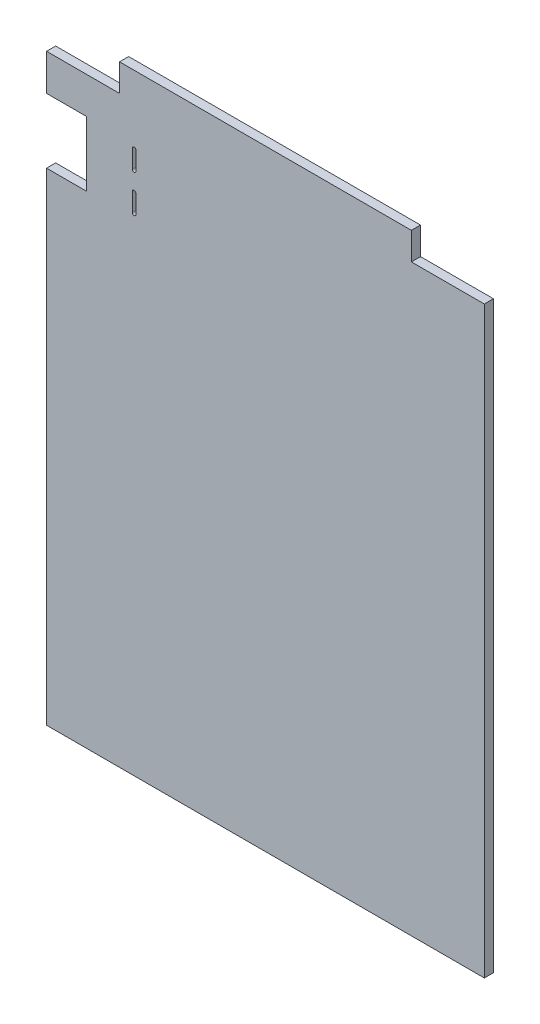
ISO-10303-21;
HEADER;
FILE_DESCRIPTION(('STEP AP214'),'2;1');
FILE_NAME('part.step','',(''),(''),'','','');
FILE_SCHEMA(('AUTOMOTIVE_DESIGN { 1 0 10303 214 1 1 1 1 }'));
ENDSEC;
DATA;
#1=APPLICATION_CONTEXT('core data for automotive mechanical design processes');
#2=APPLICATION_PROTOCOL_DEFINITION('international standard','automotive_design',2000,#1);
#3=PRODUCT_CONTEXT('',#1,'mechanical');
#4=PRODUCT('Part','Part','',(#3));
#5=PRODUCT_RELATED_PRODUCT_CATEGORY('part','',(#4));
#6=PRODUCT_DEFINITION_FORMATION('','',#4);
#7=PRODUCT_DEFINITION_CONTEXT('part definition',#1,'design');
#8=PRODUCT_DEFINITION('design','',#6,#7);
#9=PRODUCT_DEFINITION_SHAPE('','',#8);
#10=(LENGTH_UNIT() NAMED_UNIT(*) SI_UNIT(.MILLI.,.METRE.));
#11=(NAMED_UNIT(*) PLANE_ANGLE_UNIT() SI_UNIT($,.RADIAN.));
#12=(NAMED_UNIT(*) SI_UNIT($,.STERADIAN.) SOLID_ANGLE_UNIT());
#13=UNCERTAINTY_MEASURE_WITH_UNIT(LENGTH_MEASURE(1.E-05),#10,'distance_accuracy_value','');
#14=(GEOMETRIC_REPRESENTATION_CONTEXT(3) GLOBAL_UNCERTAINTY_ASSIGNED_CONTEXT((#13)) GLOBAL_UNIT_ASSIGNED_CONTEXT((#10,
#11,#12)) REPRESENTATION_CONTEXT('',''));
#15=CARTESIAN_POINT('',(0.,0.,0.));
#16=DIRECTION('',(0.,0.,1.));
#17=DIRECTION('',(1.,0.,0.));
#18=AXIS2_PLACEMENT_3D('',#15,#16,#17);
#19=CARTESIAN_POINT('',(-290.,335.,10.));
#20=DIRECTION('',(1.,0.,0.));
#21=DIRECTION('',(0.,1.,0.));
#22=AXIS2_PLACEMENT_3D('',#19,#20,#21);
#23=PLANE('',#22);
#24=DIRECTION('',(0.,-1.,0.));
#25=VECTOR('',#24,1.);
#26=CARTESIAN_POINT('',(-290.,335.,10.));
#27=LINE('',#26,#25);
#28=CARTESIAN_POINT('',(-290.,194.,10.));
#29=VERTEX_POINT('',#28);
#30=CARTESIAN_POINT('',(-290.,-335.,10.));
#31=VERTEX_POINT('',#30);
#32=EDGE_CURVE('E305',#29,#31,#27,.T.);
#33=ORIENTED_EDGE('',*,*,#32,.F.);
#34=DIRECTION('',(0.,0.,-1.));
#35=VECTOR('',#34,1.);
#36=CARTESIAN_POINT('',(-290.,194.,10.));
#37=LINE('',#36,#35);
#38=CARTESIAN_POINT('',(-290.,194.,0.));
#39=VERTEX_POINT('',#38);
#40=EDGE_CURVE('E256',#29,#39,#37,.T.);
#41=ORIENTED_EDGE('',*,*,#40,.T.);
#42=DIRECTION('',(0.,-1.,0.));
#43=VECTOR('',#42,1.);
#44=CARTESIAN_POINT('',(-290.,335.,0.));
#45=LINE('',#44,#43);
#46=CARTESIAN_POINT('',(-290.,-335.,0.));
#47=VERTEX_POINT('',#46);
#48=EDGE_CURVE('E297',#39,#47,#45,.T.);
#49=ORIENTED_EDGE('',*,*,#48,.T.);
#50=DIRECTION('',(0.,0.,-1.));
#51=VECTOR('',#50,1.);
#52=CARTESIAN_POINT('',(-290.,-335.,10.));
#53=LINE('',#52,#51);
#54=EDGE_CURVE('E11',#31,#47,#53,.T.);
#55=ORIENTED_EDGE('',*,*,#54,.F.);
#56=EDGE_LOOP('',(#33,#41,#49,#55));
#57=FACE_BOUND('',#56,.T.);
#58=ADVANCED_FACE('F33',(#57),#23,.F.);
#59=CARTESIAN_POINT('',(-290.,305.,0.));
#60=VERTEX_POINT('',#59);
#61=CARTESIAN_POINT('',(-290.,265.,0.));
#62=VERTEX_POINT('',#61);
#63=EDGE_CURVE('E313',#60,#62,#45,.T.);
#64=ORIENTED_EDGE('',*,*,#63,.T.);
#65=DIRECTION('',(0.,0.,-1.));
#66=VECTOR('',#65,1.);
#67=CARTESIAN_POINT('',(-290.,265.,10.));
#68=LINE('',#67,#66);
#69=CARTESIAN_POINT('',(-290.,265.,10.));
#70=VERTEX_POINT('',#69);
#71=EDGE_CURVE('E249',#70,#62,#68,.T.);
#72=ORIENTED_EDGE('',*,*,#71,.F.);
#73=CARTESIAN_POINT('',(-290.,305.,10.));
#74=VERTEX_POINT('',#73);
#75=EDGE_CURVE('E301',#74,#70,#27,.T.);
#76=ORIENTED_EDGE('',*,*,#75,.F.);
#77=DIRECTION('',(0.,0.,-1.));
#78=VECTOR('',#77,1.);
#79=CARTESIAN_POINT('',(-290.,305.,10.));
#80=LINE('',#79,#78);
#81=EDGE_CURVE('E276',#74,#60,#80,.T.);
#82=ORIENTED_EDGE('',*,*,#81,.T.);
#83=EDGE_LOOP('',(#64,#72,#76,#82));
#84=FACE_BOUND('',#83,.T.);
#85=ADVANCED_FACE('F35',(#84),#23,.F.);
#86=CARTESIAN_POINT('',(-290.,-335.,10.));
#87=DIRECTION('',(0.,1.,0.));
#88=DIRECTION('',(0.,0.,1.));
#89=AXIS2_PLACEMENT_3D('',#86,#87,#88);
#90=PLANE('',#89);
#91=DIRECTION('',(1.,0.,0.));
#92=VECTOR('',#91,1.);
#93=CARTESIAN_POINT('',(-290.,-335.,0.));
#94=LINE('',#93,#92);
#95=CARTESIAN_POINT('',(190.,-335.,0.));
#96=VERTEX_POINT('',#95);
#97=EDGE_CURVE('E316',#47,#96,#94,.T.);
#98=ORIENTED_EDGE('',*,*,#97,.T.);
#99=DIRECTION('',(0.,0.,-1.));
#100=VECTOR('',#99,1.);
#101=CARTESIAN_POINT('',(190.,-335.,10.));
#102=LINE('',#101,#100);
#103=CARTESIAN_POINT('',(190.,-335.,10.));
#104=VERTEX_POINT('',#103);
#105=EDGE_CURVE('E41',#104,#96,#102,.T.);
#106=ORIENTED_EDGE('',*,*,#105,.F.);
#107=DIRECTION('',(1.,0.,0.));
#108=VECTOR('',#107,1.);
#109=CARTESIAN_POINT('',(-290.,-335.,10.));
#110=LINE('',#109,#108);
#111=EDGE_CURVE('E304',#31,#104,#110,.T.);
#112=ORIENTED_EDGE('',*,*,#111,.F.);
#113=ORIENTED_EDGE('',*,*,#54,.T.);
#114=EDGE_LOOP('',(#98,#106,#112,#113));
#115=FACE_BOUND('',#114,.T.);
#116=ADVANCED_FACE('F345',(#115),#90,.F.);
#117=CARTESIAN_POINT('',(190.,335.,10.));
#118=DIRECTION('',(-1.,0.,0.));
#119=DIRECTION('',(0.,-1.,0.));
#120=AXIS2_PLACEMENT_3D('',#117,#118,#119);
#121=PLANE('',#120);
#122=DIRECTION('',(0.,1.,0.));
#123=VECTOR('',#122,1.);
#124=CARTESIAN_POINT('',(190.,335.,0.));
#125=LINE('',#124,#123);
#126=CARTESIAN_POINT('',(190.,305.,0.));
#127=VERTEX_POINT('',#126);
#128=EDGE_CURVE('E318',#96,#127,#125,.T.);
#129=ORIENTED_EDGE('',*,*,#128,.T.);
#130=DIRECTION('',(0.,0.,-1.));
#131=VECTOR('',#130,1.);
#132=CARTESIAN_POINT('',(190.,305.,10.));
#133=LINE('',#132,#131);
#134=CARTESIAN_POINT('',(190.,305.,10.));
#135=VERTEX_POINT('',#134);
#136=EDGE_CURVE('E290',#135,#127,#133,.T.);
#137=ORIENTED_EDGE('',*,*,#136,.F.);
#138=DIRECTION('',(0.,1.,0.));
#139=VECTOR('',#138,1.);
#140=CARTESIAN_POINT('',(190.,335.,10.));
#141=LINE('',#140,#139);
#142=EDGE_CURVE('E307',#104,#135,#141,.T.);
#143=ORIENTED_EDGE('',*,*,#142,.F.);
#144=ORIENTED_EDGE('',*,*,#105,.T.);
#145=EDGE_LOOP('',(#129,#137,#143,#144));
#146=FACE_BOUND('',#145,.T.);
#147=ADVANCED_FACE('F328',(#146),#121,.F.);
#148=CARTESIAN_POINT('',(-290.,335.,10.));
#149=DIRECTION('',(0.,-1.,0.));
#150=DIRECTION('',(0.,0.,-1.));
#151=AXIS2_PLACEMENT_3D('',#148,#149,#150);
#152=PLANE('',#151);
#153=DIRECTION('',(-1.,0.,0.));
#154=VECTOR('',#153,1.);
#155=CARTESIAN_POINT('',(-290.,335.,0.));
#156=LINE('',#155,#154);
#157=CARTESIAN_POINT('',(110.,335.,0.));
#158=VERTEX_POINT('',#157);
#159=CARTESIAN_POINT('',(-210.,335.,0.));
#160=VERTEX_POINT('',#159);
#161=EDGE_CURVE('E321',#158,#160,#156,.T.);
#162=ORIENTED_EDGE('',*,*,#161,.T.);
#163=DIRECTION('',(0.,0.,-1.));
#164=VECTOR('',#163,1.);
#165=CARTESIAN_POINT('',(-210.,335.,10.));
#166=LINE('',#165,#164);
#167=CARTESIAN_POINT('',(-210.,335.,10.));
#168=VERTEX_POINT('',#167);
#169=EDGE_CURVE('E272',#168,#160,#166,.T.);
#170=ORIENTED_EDGE('',*,*,#169,.F.);
#171=DIRECTION('',(-1.,0.,0.));
#172=VECTOR('',#171,1.);
#173=CARTESIAN_POINT('',(-290.,335.,10.));
#174=LINE('',#173,#172);
#175=CARTESIAN_POINT('',(110.,335.,10.));
#176=VERTEX_POINT('',#175);
#177=EDGE_CURVE('E310',#176,#168,#174,.T.);
#178=ORIENTED_EDGE('',*,*,#177,.F.);
#179=DIRECTION('',(0.,0.,-1.));
#180=VECTOR('',#179,1.);
#181=CARTESIAN_POINT('',(110.,335.,10.));
#182=LINE('',#181,#180);
#183=EDGE_CURVE('E294',#176,#158,#182,.T.);
#184=ORIENTED_EDGE('',*,*,#183,.T.);
#185=EDGE_LOOP('',(#162,#170,#178,#184));
#186=FACE_BOUND('',#185,.T.);
#187=ADVANCED_FACE('F372',(#186),#152,.F.);
#188=CARTESIAN_POINT('',(0.,0.,10.));
#189=DIRECTION('',(0.,0.,1.));
#190=DIRECTION('',(1.,0.,0.));
#191=AXIS2_PLACEMENT_3D('',#188,#189,#190);
#192=PLANE('',#191);
#193=CARTESIAN_POINT('',(-194.,219.,10.));
#194=DIRECTION('',(0.,0.,-1.));
#195=DIRECTION('',(-1.,0.,0.));
#196=AXIS2_PLACEMENT_3D('',#193,#194,#195);
#197=CIRCLE('',#196,2.);
#198=CARTESIAN_POINT('',(-196.,219.,10.));
#199=VERTEX_POINT('',#198);
#200=CARTESIAN_POINT('',(-192.,219.,10.));
#201=VERTEX_POINT('',#200);
#202=EDGE_CURVE('E172',#199,#201,#197,.T.);
#203=ORIENTED_EDGE('',*,*,#202,.T.);
#204=DIRECTION('',(0.,-1.,0.));
#205=VECTOR('',#204,1.);
#206=CARTESIAN_POINT('',(-192.,219.,10.));
#207=LINE('',#206,#205);
#208=CARTESIAN_POINT('',(-192.,199.,10.));
#209=VERTEX_POINT('',#208);
#210=EDGE_CURVE('E181',#201,#209,#207,.T.);
#211=ORIENTED_EDGE('',*,*,#210,.T.);
#212=CARTESIAN_POINT('',(-194.,199.,10.));
#213=DIRECTION('',(0.,0.,-1.));
#214=DIRECTION('',(-1.,0.,0.));
#215=AXIS2_PLACEMENT_3D('',#212,#213,#214);
#216=CIRCLE('',#215,2.00000000000002);
#217=CARTESIAN_POINT('',(-196.,199.,10.));
#218=VERTEX_POINT('',#217);
#219=EDGE_CURVE('E48',#209,#218,#216,.T.);
#220=ORIENTED_EDGE('',*,*,#219,.T.);
#221=DIRECTION('',(0.,1.,0.));
#222=VECTOR('',#221,1.);
#223=CARTESIAN_POINT('',(-196.,199.,10.));
#224=LINE('',#223,#222);
#225=EDGE_CURVE('E178',#218,#199,#224,.T.);
#226=ORIENTED_EDGE('',*,*,#225,.T.);
#227=EDGE_LOOP('',(#203,#211,#220,#226));
#228=FACE_BOUND('',#227,.T.);
#229=CARTESIAN_POINT('',(-194.,260.,10.));
#230=DIRECTION('',(0.,0.,-1.));
#231=DIRECTION('',(-1.,0.,0.));
#232=AXIS2_PLACEMENT_3D('',#229,#230,#231);
#233=CIRCLE('',#232,2.);
#234=CARTESIAN_POINT('',(-196.,260.,10.));
#235=VERTEX_POINT('',#234);
#236=CARTESIAN_POINT('',(-192.,260.,10.));
#237=VERTEX_POINT('',#236);
#238=EDGE_CURVE('E207',#235,#237,#233,.T.);
#239=ORIENTED_EDGE('',*,*,#238,.T.);
#240=DIRECTION('',(0.,-1.,0.));
#241=VECTOR('',#240,1.);
#242=CARTESIAN_POINT('',(-192.,260.,10.));
#243=LINE('',#242,#241);
#244=CARTESIAN_POINT('',(-192.,240.,10.));
#245=VERTEX_POINT('',#244);
#246=EDGE_CURVE('E210',#237,#245,#243,.T.);
#247=ORIENTED_EDGE('',*,*,#246,.T.);
#248=CARTESIAN_POINT('',(-194.,240.,10.));
#249=DIRECTION('',(0.,0.,-1.));
#250=DIRECTION('',(-1.,0.,0.));
#251=AXIS2_PLACEMENT_3D('',#248,#249,#250);
#252=CIRCLE('',#251,2.);
#253=CARTESIAN_POINT('',(-196.,240.,10.));
#254=VERTEX_POINT('',#253);
#255=EDGE_CURVE('E214',#245,#254,#252,.T.);
#256=ORIENTED_EDGE('',*,*,#255,.T.);
#257=DIRECTION('',(0.,1.,0.));
#258=VECTOR('',#257,1.);
#259=CARTESIAN_POINT('',(-196.,260.,10.));
#260=LINE('',#259,#258);
#261=EDGE_CURVE('E217',#254,#235,#260,.T.);
#262=ORIENTED_EDGE('',*,*,#261,.T.);
#263=EDGE_LOOP('',(#239,#247,#256,#262));
#264=FACE_BOUND('',#263,.T.);
#265=DIRECTION('',(-1.,0.,0.));
#266=VECTOR('',#265,1.);
#267=CARTESIAN_POINT('',(-290.,194.,10.));
#268=LINE('',#267,#266);
#269=CARTESIAN_POINT('',(-246.,194.,10.));
#270=VERTEX_POINT('',#269);
#271=EDGE_CURVE('E246',#270,#29,#268,.T.);
#272=ORIENTED_EDGE('',*,*,#271,.T.);
#273=ORIENTED_EDGE('',*,*,#32,.T.);
#274=ORIENTED_EDGE('',*,*,#111,.T.);
#275=ORIENTED_EDGE('',*,*,#142,.T.);
#276=DIRECTION('',(-1.,0.,0.));
#277=VECTOR('',#276,1.);
#278=CARTESIAN_POINT('',(190.,305.,10.));
#279=LINE('',#278,#277);
#280=CARTESIAN_POINT('',(110.,305.,10.));
#281=VERTEX_POINT('',#280);
#282=EDGE_CURVE('E283',#135,#281,#279,.T.);
#283=ORIENTED_EDGE('',*,*,#282,.T.);
#284=DIRECTION('',(0.,1.,0.));
#285=VECTOR('',#284,1.);
#286=CARTESIAN_POINT('',(110.,335.,10.));
#287=LINE('',#286,#285);
#288=EDGE_CURVE('E286',#281,#176,#287,.T.);
#289=ORIENTED_EDGE('',*,*,#288,.T.);
#290=ORIENTED_EDGE('',*,*,#177,.T.);
#291=DIRECTION('',(0.,-1.,0.));
#292=VECTOR('',#291,1.);
#293=CARTESIAN_POINT('',(-210.,335.,10.));
#294=LINE('',#293,#292);
#295=CARTESIAN_POINT('',(-210.,305.,10.));
#296=VERTEX_POINT('',#295);
#297=EDGE_CURVE('E265',#168,#296,#294,.T.);
#298=ORIENTED_EDGE('',*,*,#297,.T.);
#299=DIRECTION('',(-1.,0.,0.));
#300=VECTOR('',#299,1.);
#301=CARTESIAN_POINT('',(-290.,305.,10.));
#302=LINE('',#301,#300);
#303=EDGE_CURVE('E268',#296,#74,#302,.T.);
#304=ORIENTED_EDGE('',*,*,#303,.T.);
#305=ORIENTED_EDGE('',*,*,#75,.T.);
#306=DIRECTION('',(1.,0.,0.));
#307=VECTOR('',#306,1.);
#308=CARTESIAN_POINT('',(-290.,265.,10.));
#309=LINE('',#308,#307);
#310=CARTESIAN_POINT('',(-246.,265.,10.));
#311=VERTEX_POINT('',#310);
#312=EDGE_CURVE('E239',#70,#311,#309,.T.);
#313=ORIENTED_EDGE('',*,*,#312,.T.);
#314=DIRECTION('',(0.,-1.,0.));
#315=VECTOR('',#314,1.);
#316=CARTESIAN_POINT('',(-246.,265.,10.));
#317=LINE('',#316,#315);
#318=EDGE_CURVE('E242',#311,#270,#317,.T.);
#319=ORIENTED_EDGE('',*,*,#318,.T.);
#320=EDGE_LOOP('',(#272,#273,#274,#275,#283,#289,#290,#298,#304,#305,#313,#319));
#321=FACE_BOUND('',#320,.T.);
#322=ADVANCED_FACE('F185',(#228,#264,#321),#192,.T.);
#323=CARTESIAN_POINT('',(0.,0.,0.));
#324=DIRECTION('',(0.,0.,1.));
#325=DIRECTION('',(1.,0.,0.));
#326=AXIS2_PLACEMENT_3D('',#323,#324,#325);
#327=PLANE('',#326);
#328=DIRECTION('',(0.,-1.,0.));
#329=VECTOR('',#328,1.);
#330=CARTESIAN_POINT('',(-192.,219.,0.));
#331=LINE('',#330,#329);
#332=CARTESIAN_POINT('',(-192.,219.,0.));
#333=VERTEX_POINT('',#332);
#334=CARTESIAN_POINT('',(-192.,199.,0.));
#335=VERTEX_POINT('',#334);
#336=EDGE_CURVE('E197',#333,#335,#331,.T.);
#337=ORIENTED_EDGE('',*,*,#336,.F.);
#338=CARTESIAN_POINT('',(-194.,219.,0.));
#339=DIRECTION('',(0.,0.,-1.));
#340=DIRECTION('',(-1.,0.,0.));
#341=AXIS2_PLACEMENT_3D('',#338,#339,#340);
#342=CIRCLE('',#341,2.);
#343=CARTESIAN_POINT('',(-196.,219.,0.));
#344=VERTEX_POINT('',#343);
#345=EDGE_CURVE('E56',#344,#333,#342,.T.);
#346=ORIENTED_EDGE('',*,*,#345,.F.);
#347=DIRECTION('',(0.,1.,0.));
#348=VECTOR('',#347,1.);
#349=CARTESIAN_POINT('',(-196.,199.,0.));
#350=LINE('',#349,#348);
#351=CARTESIAN_POINT('',(-196.,199.,0.));
#352=VERTEX_POINT('',#351);
#353=EDGE_CURVE('E188',#352,#344,#350,.T.);
#354=ORIENTED_EDGE('',*,*,#353,.F.);
#355=CARTESIAN_POINT('',(-194.,199.,0.));
#356=DIRECTION('',(0.,0.,-1.));
#357=DIRECTION('',(-1.,0.,0.));
#358=AXIS2_PLACEMENT_3D('',#355,#356,#357);
#359=CIRCLE('',#358,2.00000000000002);
#360=EDGE_CURVE('E191',#335,#352,#359,.T.);
#361=ORIENTED_EDGE('',*,*,#360,.F.);
#362=EDGE_LOOP('',(#337,#346,#354,#361));
#363=FACE_BOUND('',#362,.T.);
#364=DIRECTION('',(0.,-1.,0.));
#365=VECTOR('',#364,1.);
#366=CARTESIAN_POINT('',(-192.,260.,0.));
#367=LINE('',#366,#365);
#368=CARTESIAN_POINT('',(-192.,260.,0.));
#369=VERTEX_POINT('',#368);
#370=CARTESIAN_POINT('',(-192.,240.,0.));
#371=VERTEX_POINT('',#370);
#372=EDGE_CURVE('E222',#369,#371,#367,.T.);
#373=ORIENTED_EDGE('',*,*,#372,.F.);
#374=CARTESIAN_POINT('',(-194.,260.,0.));
#375=DIRECTION('',(0.,0.,-1.));
#376=DIRECTION('',(-1.,0.,0.));
#377=AXIS2_PLACEMENT_3D('',#374,#375,#376);
#378=CIRCLE('',#377,2.);
#379=CARTESIAN_POINT('',(-196.,260.,0.));
#380=VERTEX_POINT('',#379);
#381=EDGE_CURVE('E203',#380,#369,#378,.T.);
#382=ORIENTED_EDGE('',*,*,#381,.F.);
#383=DIRECTION('',(0.,1.,0.));
#384=VECTOR('',#383,1.);
#385=CARTESIAN_POINT('',(-196.,260.,0.));
#386=LINE('',#385,#384);
#387=CARTESIAN_POINT('',(-196.,240.,0.));
#388=VERTEX_POINT('',#387);
#389=EDGE_CURVE('E211',#388,#380,#386,.T.);
#390=ORIENTED_EDGE('',*,*,#389,.F.);
#391=CARTESIAN_POINT('',(-194.,240.,0.));
#392=DIRECTION('',(0.,0.,-1.));
#393=DIRECTION('',(-1.,0.,0.));
#394=AXIS2_PLACEMENT_3D('',#391,#392,#393);
#395=CIRCLE('',#394,2.);
#396=EDGE_CURVE('E225',#371,#388,#395,.T.);
#397=ORIENTED_EDGE('',*,*,#396,.F.);
#398=EDGE_LOOP('',(#373,#382,#390,#397));
#399=FACE_BOUND('',#398,.T.);
#400=ORIENTED_EDGE('',*,*,#48,.F.);
#401=DIRECTION('',(-1.,0.,0.));
#402=VECTOR('',#401,1.);
#403=CARTESIAN_POINT('',(-290.,194.,0.));
#404=LINE('',#403,#402);
#405=CARTESIAN_POINT('',(-246.,194.,0.));
#406=VERTEX_POINT('',#405);
#407=EDGE_CURVE('E243',#406,#39,#404,.T.);
#408=ORIENTED_EDGE('',*,*,#407,.F.);
#409=DIRECTION('',(0.,-1.,0.));
#410=VECTOR('',#409,1.);
#411=CARTESIAN_POINT('',(-246.,265.,0.));
#412=LINE('',#411,#410);
#413=CARTESIAN_POINT('',(-246.,265.,0.));
#414=VERTEX_POINT('',#413);
#415=EDGE_CURVE('E252',#414,#406,#412,.T.);
#416=ORIENTED_EDGE('',*,*,#415,.F.);
#417=DIRECTION('',(1.,0.,0.));
#418=VECTOR('',#417,1.);
#419=CARTESIAN_POINT('',(-290.,265.,0.));
#420=LINE('',#419,#418);
#421=EDGE_CURVE('E232',#62,#414,#420,.T.);
#422=ORIENTED_EDGE('',*,*,#421,.F.);
#423=ORIENTED_EDGE('',*,*,#63,.F.);
#424=DIRECTION('',(-1.,0.,0.));
#425=VECTOR('',#424,1.);
#426=CARTESIAN_POINT('',(-290.,305.,0.));
#427=LINE('',#426,#425);
#428=CARTESIAN_POINT('',(-210.,305.,0.));
#429=VERTEX_POINT('',#428);
#430=EDGE_CURVE('E269',#429,#60,#427,.T.);
#431=ORIENTED_EDGE('',*,*,#430,.F.);
#432=DIRECTION('',(0.,-1.,0.));
#433=VECTOR('',#432,1.);
#434=CARTESIAN_POINT('',(-210.,335.,0.));
#435=LINE('',#434,#433);
#436=EDGE_CURVE('E259',#160,#429,#435,.T.);
#437=ORIENTED_EDGE('',*,*,#436,.F.);
#438=ORIENTED_EDGE('',*,*,#161,.F.);
#439=DIRECTION('',(0.,1.,0.));
#440=VECTOR('',#439,1.);
#441=CARTESIAN_POINT('',(110.,335.,0.));
#442=LINE('',#441,#440);
#443=CARTESIAN_POINT('',(110.,305.,0.));
#444=VERTEX_POINT('',#443);
#445=EDGE_CURVE('E287',#444,#158,#442,.T.);
#446=ORIENTED_EDGE('',*,*,#445,.F.);
#447=DIRECTION('',(-1.,0.,0.));
#448=VECTOR('',#447,1.);
#449=CARTESIAN_POINT('',(190.,305.,0.));
#450=LINE('',#449,#448);
#451=EDGE_CURVE('E279',#127,#444,#450,.T.);
#452=ORIENTED_EDGE('',*,*,#451,.F.);
#453=ORIENTED_EDGE('',*,*,#128,.F.);
#454=ORIENTED_EDGE('',*,*,#97,.F.);
#455=EDGE_LOOP('',(#400,#408,#416,#422,#423,#431,#437,#438,#446,#452,#453,#454));
#456=FACE_BOUND('',#455,.T.);
#457=ADVANCED_FACE('F336',(#363,#399,#456),#327,.F.);
#458=CARTESIAN_POINT('',(110.,335.,10.));
#459=DIRECTION('',(-1.,0.,0.));
#460=DIRECTION('',(0.,0.,1.));
#461=AXIS2_PLACEMENT_3D('',#458,#459,#460);
#462=PLANE('',#461);
#463=ORIENTED_EDGE('',*,*,#445,.T.);
#464=ORIENTED_EDGE('',*,*,#183,.F.);
#465=ORIENTED_EDGE('',*,*,#288,.F.);
#466=DIRECTION('',(0.,0.,-1.));
#467=VECTOR('',#466,1.);
#468=CARTESIAN_POINT('',(110.,305.,10.));
#469=LINE('',#468,#467);
#470=EDGE_CURVE('E298',#281,#444,#469,.T.);
#471=ORIENTED_EDGE('',*,*,#470,.T.);
#472=EDGE_LOOP('',(#463,#464,#465,#471));
#473=FACE_BOUND('',#472,.T.);
#474=ADVANCED_FACE('F374',(#473),#462,.F.);
#475=CARTESIAN_POINT('',(190.,305.,10.));
#476=DIRECTION('',(0.,-1.,0.));
#477=DIRECTION('',(1.,0.,0.));
#478=AXIS2_PLACEMENT_3D('',#475,#476,#477);
#479=PLANE('',#478);
#480=ORIENTED_EDGE('',*,*,#451,.T.);
#481=ORIENTED_EDGE('',*,*,#470,.F.);
#482=ORIENTED_EDGE('',*,*,#282,.F.);
#483=ORIENTED_EDGE('',*,*,#136,.T.);
#484=EDGE_LOOP('',(#480,#481,#482,#483));
#485=FACE_BOUND('',#484,.T.);
#486=ADVANCED_FACE('F340',(#485),#479,.F.);
#487=CARTESIAN_POINT('',(-290.,305.,10.));
#488=DIRECTION('',(0.,-1.,0.));
#489=DIRECTION('',(0.,0.,-1.));
#490=AXIS2_PLACEMENT_3D('',#487,#488,#489);
#491=PLANE('',#490);
#492=ORIENTED_EDGE('',*,*,#430,.T.);
#493=ORIENTED_EDGE('',*,*,#81,.F.);
#494=ORIENTED_EDGE('',*,*,#303,.F.);
#495=DIRECTION('',(0.,0.,-1.));
#496=VECTOR('',#495,1.);
#497=CARTESIAN_POINT('',(-210.,305.,10.));
#498=LINE('',#497,#496);
#499=EDGE_CURVE('E280',#296,#429,#498,.T.);
#500=ORIENTED_EDGE('',*,*,#499,.T.);
#501=EDGE_LOOP('',(#492,#493,#494,#500));
#502=FACE_BOUND('',#501,.T.);
#503=ADVANCED_FACE('F365',(#502),#491,.F.);
#504=CARTESIAN_POINT('',(-210.,335.,10.));
#505=DIRECTION('',(1.,0.,0.));
#506=DIRECTION('',(0.,0.,-1.));
#507=AXIS2_PLACEMENT_3D('',#504,#505,#506);
#508=PLANE('',#507);
#509=ORIENTED_EDGE('',*,*,#436,.T.);
#510=ORIENTED_EDGE('',*,*,#499,.F.);
#511=ORIENTED_EDGE('',*,*,#297,.F.);
#512=ORIENTED_EDGE('',*,*,#169,.T.);
#513=EDGE_LOOP('',(#509,#510,#511,#512));
#514=FACE_BOUND('',#513,.T.);
#515=ADVANCED_FACE('F369',(#514),#508,.F.);
#516=CARTESIAN_POINT('',(-290.,194.,10.));
#517=DIRECTION('',(0.,-1.,0.));
#518=DIRECTION('',(0.,0.,-1.));
#519=AXIS2_PLACEMENT_3D('',#516,#517,#518);
#520=PLANE('',#519);
#521=ORIENTED_EDGE('',*,*,#407,.T.);
#522=ORIENTED_EDGE('',*,*,#40,.F.);
#523=ORIENTED_EDGE('',*,*,#271,.F.);
#524=DIRECTION('',(0.,0.,-1.));
#525=VECTOR('',#524,1.);
#526=CARTESIAN_POINT('',(-246.,194.,10.));
#527=LINE('',#526,#525);
#528=EDGE_CURVE('E260',#270,#406,#527,.T.);
#529=ORIENTED_EDGE('',*,*,#528,.T.);
#530=EDGE_LOOP('',(#521,#522,#523,#529));
#531=FACE_BOUND('',#530,.T.);
#532=ADVANCED_FACE('F351',(#531),#520,.F.);
#533=CARTESIAN_POINT('',(-246.,265.,10.));
#534=DIRECTION('',(1.,0.,0.));
#535=DIRECTION('',(0.,0.,-1.));
#536=AXIS2_PLACEMENT_3D('',#533,#534,#535);
#537=PLANE('',#536);
#538=ORIENTED_EDGE('',*,*,#415,.T.);
#539=ORIENTED_EDGE('',*,*,#528,.F.);
#540=ORIENTED_EDGE('',*,*,#318,.F.);
#541=DIRECTION('',(0.,0.,-1.));
#542=VECTOR('',#541,1.);
#543=CARTESIAN_POINT('',(-246.,265.,10.));
#544=LINE('',#543,#542);
#545=EDGE_CURVE('E262',#311,#414,#544,.T.);
#546=ORIENTED_EDGE('',*,*,#545,.T.);
#547=EDGE_LOOP('',(#538,#539,#540,#546));
#548=FACE_BOUND('',#547,.T.);
#549=ADVANCED_FACE('F355',(#548),#537,.F.);
#550=CARTESIAN_POINT('',(-290.,265.,10.));
#551=DIRECTION('',(0.,1.,0.));
#552=DIRECTION('',(0.,0.,1.));
#553=AXIS2_PLACEMENT_3D('',#550,#551,#552);
#554=PLANE('',#553);
#555=ORIENTED_EDGE('',*,*,#421,.T.);
#556=ORIENTED_EDGE('',*,*,#545,.F.);
#557=ORIENTED_EDGE('',*,*,#312,.F.);
#558=ORIENTED_EDGE('',*,*,#71,.T.);
#559=EDGE_LOOP('',(#555,#556,#557,#558));
#560=FACE_BOUND('',#559,.T.);
#561=ADVANCED_FACE('F357',(#560),#554,.F.);
#562=CARTESIAN_POINT('',(-194.,260.,10.));
#563=DIRECTION('',(0.,0.,-1.));
#564=DIRECTION('',(-1.,0.,0.));
#565=AXIS2_PLACEMENT_3D('',#562,#563,#564);
#566=CYLINDRICAL_SURFACE('',#565,2.);
#567=ORIENTED_EDGE('',*,*,#381,.T.);
#568=DIRECTION('',(0.,0.,-1.));
#569=VECTOR('',#568,1.);
#570=CARTESIAN_POINT('',(-192.,260.,10.));
#571=LINE('',#570,#569);
#572=EDGE_CURVE('E220',#237,#369,#571,.T.);
#573=ORIENTED_EDGE('',*,*,#572,.F.);
#574=ORIENTED_EDGE('',*,*,#238,.F.);
#575=DIRECTION('',(0.,0.,-1.));
#576=VECTOR('',#575,1.);
#577=CARTESIAN_POINT('',(-196.,260.,10.));
#578=LINE('',#577,#576);
#579=EDGE_CURVE('E230',#235,#380,#578,.T.);
#580=ORIENTED_EDGE('',*,*,#579,.T.);
#581=EDGE_LOOP('',(#567,#573,#574,#580));
#582=FACE_BOUND('',#581,.T.);
#583=ADVANCED_FACE('F433',(#582),#566,.F.);
#584=CARTESIAN_POINT('',(-196.,260.,10.));
#585=DIRECTION('',(-1.,0.,0.));
#586=DIRECTION('',(0.,0.,1.));
#587=AXIS2_PLACEMENT_3D('',#584,#585,#586);
#588=PLANE('',#587);
#589=ORIENTED_EDGE('',*,*,#389,.T.);
#590=ORIENTED_EDGE('',*,*,#579,.F.);
#591=ORIENTED_EDGE('',*,*,#261,.F.);
#592=DIRECTION('',(0.,0.,-1.));
#593=VECTOR('',#592,1.);
#594=CARTESIAN_POINT('',(-196.,240.,10.));
#595=LINE('',#594,#593);
#596=EDGE_CURVE('E233',#254,#388,#595,.T.);
#597=ORIENTED_EDGE('',*,*,#596,.T.);
#598=EDGE_LOOP('',(#589,#590,#591,#597));
#599=FACE_BOUND('',#598,.T.);
#600=ADVANCED_FACE('F442',(#599),#588,.F.);
#601=CARTESIAN_POINT('',(-194.,240.,10.));
#602=DIRECTION('',(0.,0.,-1.));
#603=DIRECTION('',(-1.,0.,0.));
#604=AXIS2_PLACEMENT_3D('',#601,#602,#603);
#605=CYLINDRICAL_SURFACE('',#604,2.);
#606=ORIENTED_EDGE('',*,*,#396,.T.);
#607=ORIENTED_EDGE('',*,*,#596,.F.);
#608=ORIENTED_EDGE('',*,*,#255,.F.);
#609=DIRECTION('',(0.,0.,-1.));
#610=VECTOR('',#609,1.);
#611=CARTESIAN_POINT('',(-192.,240.,10.));
#612=LINE('',#611,#610);
#613=EDGE_CURVE('E235',#245,#371,#612,.T.);
#614=ORIENTED_EDGE('',*,*,#613,.T.);
#615=EDGE_LOOP('',(#606,#607,#608,#614));
#616=FACE_BOUND('',#615,.T.);
#617=ADVANCED_FACE('F452',(#616),#605,.F.);
#618=CARTESIAN_POINT('',(-192.,260.,10.));
#619=DIRECTION('',(1.,0.,0.));
#620=DIRECTION('',(0.,0.,-1.));
#621=AXIS2_PLACEMENT_3D('',#618,#619,#620);
#622=PLANE('',#621);
#623=ORIENTED_EDGE('',*,*,#372,.T.);
#624=ORIENTED_EDGE('',*,*,#613,.F.);
#625=ORIENTED_EDGE('',*,*,#246,.F.);
#626=ORIENTED_EDGE('',*,*,#572,.T.);
#627=EDGE_LOOP('',(#623,#624,#625,#626));
#628=FACE_BOUND('',#627,.T.);
#629=ADVANCED_FACE('F462',(#628),#622,.F.);
#630=CARTESIAN_POINT('',(-194.,219.,10.));
#631=DIRECTION('',(0.,0.,-1.));
#632=DIRECTION('',(-1.,0.,0.));
#633=AXIS2_PLACEMENT_3D('',#630,#631,#632);
#634=CYLINDRICAL_SURFACE('',#633,2.);
#635=ORIENTED_EDGE('',*,*,#345,.T.);
#636=DIRECTION('',(0.,0.,-1.));
#637=VECTOR('',#636,1.);
#638=CARTESIAN_POINT('',(-192.,219.,10.));
#639=LINE('',#638,#637);
#640=EDGE_CURVE('E168',#201,#333,#639,.T.);
#641=ORIENTED_EDGE('',*,*,#640,.F.);
#642=ORIENTED_EDGE('',*,*,#202,.F.);
#643=DIRECTION('',(0.,0.,-1.));
#644=VECTOR('',#643,1.);
#645=CARTESIAN_POINT('',(-196.,219.,10.));
#646=LINE('',#645,#644);
#647=EDGE_CURVE('E201',#199,#344,#646,.T.);
#648=ORIENTED_EDGE('',*,*,#647,.T.);
#649=EDGE_LOOP('',(#635,#641,#642,#648));
#650=FACE_BOUND('',#649,.T.);
#651=ADVANCED_FACE('F170',(#650),#634,.F.);
#652=CARTESIAN_POINT('',(-196.,199.,10.));
#653=DIRECTION('',(-1.,0.,0.));
#654=DIRECTION('',(0.,-1.,0.));
#655=AXIS2_PLACEMENT_3D('',#652,#653,#654);
#656=PLANE('',#655);
#657=ORIENTED_EDGE('',*,*,#353,.T.);
#658=ORIENTED_EDGE('',*,*,#647,.F.);
#659=ORIENTED_EDGE('',*,*,#225,.F.);
#660=DIRECTION('',(0.,0.,-1.));
#661=VECTOR('',#660,1.);
#662=CARTESIAN_POINT('',(-196.,199.,10.));
#663=LINE('',#662,#661);
#664=EDGE_CURVE('E204',#218,#352,#663,.T.);
#665=ORIENTED_EDGE('',*,*,#664,.T.);
#666=EDGE_LOOP('',(#657,#658,#659,#665));
#667=FACE_BOUND('',#666,.T.);
#668=ADVANCED_FACE('F481',(#667),#656,.F.);
#669=CARTESIAN_POINT('',(-194.,199.,10.));
#670=DIRECTION('',(0.,0.,-1.));
#671=DIRECTION('',(-1.,0.,0.));
#672=AXIS2_PLACEMENT_3D('',#669,#670,#671);
#673=CYLINDRICAL_SURFACE('',#672,2.00000000000002);
#674=ORIENTED_EDGE('',*,*,#360,.T.);
#675=ORIENTED_EDGE('',*,*,#664,.F.);
#676=ORIENTED_EDGE('',*,*,#219,.F.);
#677=DIRECTION('',(0.,0.,-1.));
#678=VECTOR('',#677,1.);
#679=CARTESIAN_POINT('',(-192.,199.,10.));
#680=LINE('',#679,#678);
#681=EDGE_CURVE('E177',#209,#335,#680,.T.);
#682=ORIENTED_EDGE('',*,*,#681,.T.);
#683=EDGE_LOOP('',(#674,#675,#676,#682));
#684=FACE_BOUND('',#683,.T.);
#685=ADVANCED_FACE('F490',(#684),#673,.F.);
#686=CARTESIAN_POINT('',(-192.,219.,10.));
#687=DIRECTION('',(1.,0.,0.));
#688=DIRECTION('',(0.,0.,-1.));
#689=AXIS2_PLACEMENT_3D('',#686,#687,#688);
#690=PLANE('',#689);
#691=ORIENTED_EDGE('',*,*,#336,.T.);
#692=ORIENTED_EDGE('',*,*,#681,.F.);
#693=ORIENTED_EDGE('',*,*,#210,.F.);
#694=ORIENTED_EDGE('',*,*,#640,.T.);
#695=EDGE_LOOP('',(#691,#692,#693,#694));
#696=FACE_BOUND('',#695,.T.);
#697=ADVANCED_FACE('F182',(#696),#690,.F.);
#698=CLOSED_SHELL('',(#58,#85,#116,#147,#187,#322,#457,#474,#486,#503,#515,#532,#549,#561,#583,
#600,#617,#629,#651,#668,#685,#697));
#699=MANIFOLD_SOLID_BREP('B2',#698);
#700=ADVANCED_BREP_SHAPE_REPRESENTATION('',(#18,#699),#14);
#701=SHAPE_DEFINITION_REPRESENTATION(#9,#700);
ENDSEC;
END-ISO-10303-21;
